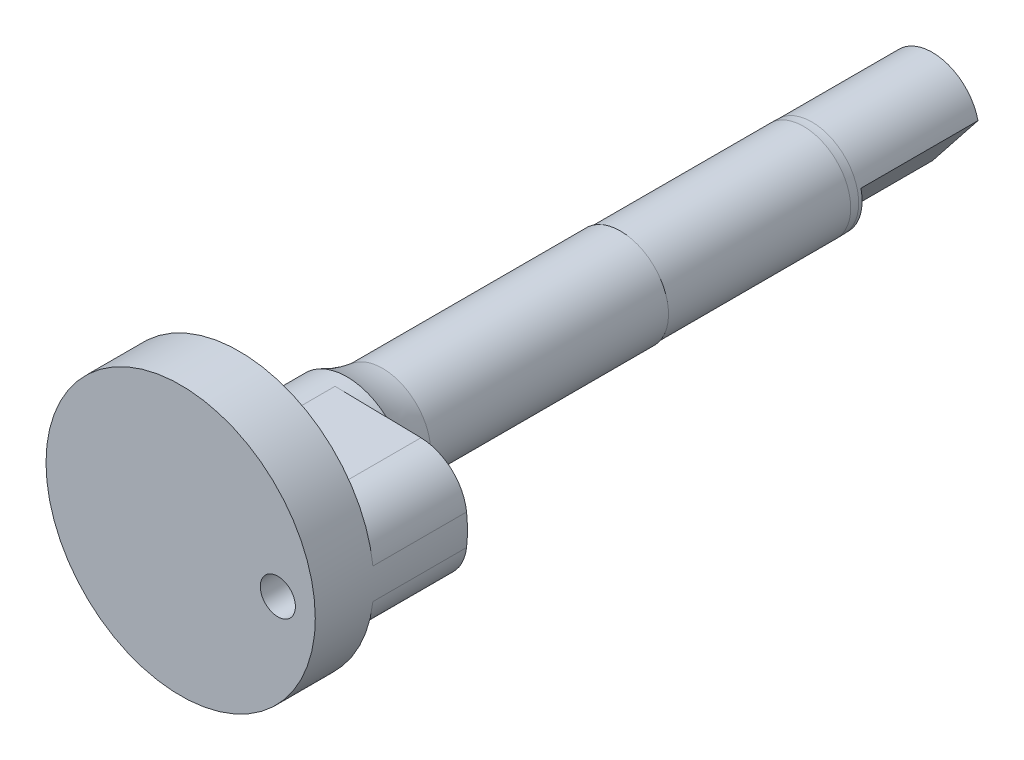
ISO-10303-21;
HEADER;
FILE_DESCRIPTION(('STEP AP214'),'2;1');
FILE_NAME('part.step','',(''),(''),'','','');
FILE_SCHEMA(('AUTOMOTIVE_DESIGN { 1 0 10303 214 1 1 1 1 }'));
ENDSEC;
DATA;
#1=APPLICATION_CONTEXT('core data for automotive mechanical design processes');
#2=APPLICATION_PROTOCOL_DEFINITION('international standard','automotive_design',2000,#1);
#3=PRODUCT_CONTEXT('',#1,'mechanical');
#4=PRODUCT('Part','Part','',(#3));
#5=PRODUCT_RELATED_PRODUCT_CATEGORY('part','',(#4));
#6=PRODUCT_DEFINITION_FORMATION('','',#4);
#7=PRODUCT_DEFINITION_CONTEXT('part definition',#1,'design');
#8=PRODUCT_DEFINITION('design','',#6,#7);
#9=PRODUCT_DEFINITION_SHAPE('','',#8);
#10=(LENGTH_UNIT() NAMED_UNIT(*) SI_UNIT(.MILLI.,.METRE.));
#11=(NAMED_UNIT(*) PLANE_ANGLE_UNIT() SI_UNIT($,.RADIAN.));
#12=(NAMED_UNIT(*) SI_UNIT($,.STERADIAN.) SOLID_ANGLE_UNIT());
#13=UNCERTAINTY_MEASURE_WITH_UNIT(LENGTH_MEASURE(1.E-05),#10,'distance_accuracy_value','');
#14=(GEOMETRIC_REPRESENTATION_CONTEXT(3) GLOBAL_UNCERTAINTY_ASSIGNED_CONTEXT((#13)) GLOBAL_UNIT_ASSIGNED_CONTEXT((#10,
#11,#12)) REPRESENTATION_CONTEXT('',''));
#15=CARTESIAN_POINT('',(0.,0.,0.));
#16=DIRECTION('',(0.,0.,1.));
#17=DIRECTION('',(1.,0.,0.));
#18=AXIS2_PLACEMENT_3D('',#15,#16,#17);
#19=CARTESIAN_POINT('',(0.,0.,100.));
#20=DIRECTION('',(0.,0.,-1.));
#21=DIRECTION('',(-1.,0.,0.));
#22=AXIS2_PLACEMENT_3D('',#19,#20,#21);
#23=CYLINDRICAL_SURFACE('',#22,5.);
#24=DIRECTION('',(0.,0.,1.));
#25=VECTOR('',#24,1.);
#26=CARTESIAN_POINT('',(0.0957609691759967,-4.99908289957093,92.));
#27=LINE('',#26,#25);
#28=CARTESIAN_POINT('',(0.0957609691759966,-4.99908289957093,92.));
#29=VERTEX_POINT('',#28);
#30=CARTESIAN_POINT('',(0.0957609691759967,-4.99908289957093,100.));
#31=VERTEX_POINT('',#30);
#32=EDGE_CURVE('E157',#29,#31,#27,.T.);
#33=ORIENTED_EDGE('',*,*,#32,.T.);
#34=CARTESIAN_POINT('',(0.,0.,100.));
#35=DIRECTION('',(0.,0.,1.));
#36=DIRECTION('',(1.,0.,0.));
#37=AXIS2_PLACEMENT_3D('',#34,#35,#36);
#38=CIRCLE('',#37,5.);
#39=CARTESIAN_POINT('',(0.190610003174259,4.99636546168211,100.));
#40=VERTEX_POINT('',#39);
#41=EDGE_CURVE('E168',#40,#31,#38,.T.);
#42=ORIENTED_EDGE('',*,*,#41,.F.);
#43=DIRECTION('',(0.,0.,-1.));
#44=VECTOR('',#43,1.);
#45=CARTESIAN_POINT('',(0.190610003174295,4.99636546168211,100.));
#46=LINE('',#45,#44);
#47=CARTESIAN_POINT('',(0.190610003174295,4.99636546168211,92.));
#48=VERTEX_POINT('',#47);
#49=EDGE_CURVE('E161',#48,#40,#46,.F.);
#50=ORIENTED_EDGE('',*,*,#49,.F.);
#51=CARTESIAN_POINT('',(0.,0.,92.));
#52=DIRECTION('',(0.,0.,-1.));
#53=DIRECTION('',(-1.,0.,0.));
#54=AXIS2_PLACEMENT_3D('',#51,#52,#53);
#55=CIRCLE('',#54,5.);
#56=EDGE_CURVE('E175',#48,#29,#55,.T.);
#57=ORIENTED_EDGE('',*,*,#56,.T.);
#58=EDGE_LOOP('',(#33,#42,#50,#57));
#59=FACE_BOUND('',#58,.T.);
#60=CARTESIAN_POINT('',(1.59132902168511E-13,3.54432033501201E-13,90.7915232092422));
#61=DIRECTION('',(0.,0.,-1.));
#62=DIRECTION('',(0.,1.,0.));
#63=AXIS2_PLACEMENT_3D('',#60,#61,#62);
#64=CIRCLE('',#63,5.00000000000009);
#65=CARTESIAN_POINT('',(1.59132902168511E-13,5.00000000000044,90.7915232092421));
#66=VERTEX_POINT('',#65);
#67=EDGE_CURVE('E117',#66,#66,#64,.T.);
#68=ORIENTED_EDGE('',*,*,#67,.F.);
#69=EDGE_LOOP('',(#68));
#70=FACE_BOUND('',#69,.T.);
#71=ADVANCED_FACE('F34',(#59,#70),#23,.T.);
#72=CARTESIAN_POINT('',(0.,0.,105.));
#73=DIRECTION('',(0.,0.,-1.));
#74=DIRECTION('',(-1.,0.,0.));
#75=AXIS2_PLACEMENT_3D('',#72,#73,#74);
#76=CYLINDRICAL_SURFACE('',#75,11.5);
#77=CARTESIAN_POINT('',(0.,0.,105.));
#78=DIRECTION('',(0.,0.,1.));
#79=DIRECTION('',(1.,0.,0.));
#80=AXIS2_PLACEMENT_3D('',#77,#78,#79);
#81=CIRCLE('',#80,11.5);
#82=CARTESIAN_POINT('',(11.5,0.,105.));
#83=VERTEX_POINT('',#82);
#84=EDGE_CURVE('E165',#83,#83,#81,.T.);
#85=ORIENTED_EDGE('',*,*,#84,.F.);
#86=EDGE_LOOP('',(#85));
#87=FACE_BOUND('',#86,.T.);
#88=DIRECTION('',(0.,0.,-1.));
#89=VECTOR('',#88,1.);
#90=CARTESIAN_POINT('',(11.4246409362969,1.31437417681885,100.));
#91=LINE('',#90,#89);
#92=CARTESIAN_POINT('',(11.4246409362969,1.31437417681885,100.));
#93=VERTEX_POINT('',#92);
#94=CARTESIAN_POINT('',(11.4246409362969,1.31437417681885,92.));
#95=VERTEX_POINT('',#94);
#96=EDGE_CURVE('E136',#93,#95,#91,.T.);
#97=ORIENTED_EDGE('',*,*,#96,.F.);
#98=CARTESIAN_POINT('',(0.,0.,100.));
#99=DIRECTION('',(0.,0.,1.));
#100=DIRECTION('',(1.,0.,0.));
#101=AXIS2_PLACEMENT_3D('',#98,#99,#100);
#102=CIRCLE('',#101,11.5);
#103=CARTESIAN_POINT('',(11.4245955728607,-1.31476841936944,100.));
#104=VERTEX_POINT('',#103);
#105=EDGE_CURVE('E164',#93,#104,#102,.T.);
#106=ORIENTED_EDGE('',*,*,#105,.T.);
#107=DIRECTION('',(0.,0.,-1.));
#108=VECTOR('',#107,1.);
#109=CARTESIAN_POINT('',(11.4245955728607,-1.31476841936944,100.));
#110=LINE('',#109,#108);
#111=CARTESIAN_POINT('',(11.4245955728607,-1.31476841936944,92.));
#112=VERTEX_POINT('',#111);
#113=EDGE_CURVE('E129',#104,#112,#110,.T.);
#114=ORIENTED_EDGE('',*,*,#113,.T.);
#115=CARTESIAN_POINT('',(0.,0.,92.));
#116=DIRECTION('',(0.,0.,-1.));
#117=DIRECTION('',(-1.,0.,0.));
#118=AXIS2_PLACEMENT_3D('',#115,#116,#117);
#119=CIRCLE('',#118,11.5);
#120=EDGE_CURVE('E152',#95,#112,#119,.T.);
#121=ORIENTED_EDGE('',*,*,#120,.F.);
#122=EDGE_LOOP('',(#97,#106,#114,#121));
#123=FACE_BOUND('',#122,.T.);
#124=ADVANCED_FACE('F205',(#87,#123),#76,.T.);
#125=CARTESIAN_POINT('',(0.,0.,92.));
#126=DIRECTION('',(0.,0.,-1.));
#127=DIRECTION('',(-1.,0.,0.));
#128=AXIS2_PLACEMENT_3D('',#125,#126,#127);
#129=PLANE('',#128);
#130=CARTESIAN_POINT('',(8.30294701481142,0.,92.));
#131=DIRECTION('',(0.,0.,-1.));
#132=DIRECTION('',(-1.,0.,0.));
#133=AXIS2_PLACEMENT_3D('',#130,#131,#132);
#134=CIRCLE('',#133,1.5);
#135=CARTESIAN_POINT('',(6.80294701481142,0.,92.));
#136=VERTEX_POINT('',#135);
#137=EDGE_CURVE('E126',#136,#136,#134,.T.);
#138=ORIENTED_EDGE('',*,*,#137,.F.);
#139=EDGE_LOOP('',(#138));
#140=FACE_BOUND('',#139,.T.);
#141=DIRECTION('',(0.999818256568768,-0.0190644651587437,0.));
#142=VECTOR('',#141,1.);
#143=CARTESIAN_POINT('',(10.4500190304664,4.80073976204611,92.));
#144=LINE('',#143,#142);
#145=CARTESIAN_POINT('',(7.52711064517646,4.85647357637432,92.));
#146=VERTEX_POINT('',#145);
#147=EDGE_CURVE('E149',#48,#146,#144,.T.);
#148=ORIENTED_EDGE('',*,*,#147,.T.);
#149=CARTESIAN_POINT('',(7.45085278454148,0.85720055009925,92.));
#150=DIRECTION('',(0.,0.,-1.));
#151=DIRECTION('',(-1.,0.,0.));
#152=AXIS2_PLACEMENT_3D('',#149,#150,#151);
#153=CIRCLE('',#152,4.);
#154=EDGE_CURVE('E132',#146,#95,#153,.T.);
#155=ORIENTED_EDGE('',*,*,#154,.T.);
#156=ORIENTED_EDGE('',*,*,#120,.T.);
#157=CARTESIAN_POINT('',(7.45082319969177,-0.85745766480616,92.));
#158=DIRECTION('',(0.,0.,-1.));
#159=DIRECTION('',(-1.,0.,0.));
#160=AXIS2_PLACEMENT_3D('',#157,#158,#159);
#161=CIRCLE('',#160,4.);
#162=CARTESIAN_POINT('',(7.52743197503257,-4.8567239844629,92.));
#163=VERTEX_POINT('',#162);
#164=EDGE_CURVE('E135',#112,#163,#161,.T.);
#165=ORIENTED_EDGE('',*,*,#164,.T.);
#166=DIRECTION('',(-0.999816579914185,-0.0191521938351995,0.));
#167=VECTOR('',#166,1.);
#168=CARTESIAN_POINT('',(10.4500190304664,-4.80073976204611,92.));
#169=LINE('',#168,#167);
#170=EDGE_CURVE('E155',#163,#29,#169,.T.);
#171=ORIENTED_EDGE('',*,*,#170,.T.);
#172=ORIENTED_EDGE('',*,*,#56,.F.);
#173=EDGE_LOOP('',(#148,#155,#156,#165,#171,#172));
#174=FACE_BOUND('',#173,.T.);
#175=ADVANCED_FACE('F211',(#140,#174),#129,.T.);
#176=CARTESIAN_POINT('',(10.4500190304664,-4.80073976204611,92.));
#177=DIRECTION('',(-0.0191521938351995,0.999816579914186,0.));
#178=DIRECTION('',(-0.999816579914186,-0.0191521938351995,0.));
#179=AXIS2_PLACEMENT_3D('',#176,#177,#178);
#180=PLANE('',#179);
#181=DIRECTION('',(0.,0.,-1.));
#182=VECTOR('',#181,1.);
#183=CARTESIAN_POINT('',(7.52743197503257,-4.8567239844629,100.));
#184=LINE('',#183,#182);
#185=CARTESIAN_POINT('',(7.52743197503257,-4.8567239844629,100.));
#186=VERTEX_POINT('',#185);
#187=EDGE_CURVE('E141',#186,#163,#184,.T.);
#188=ORIENTED_EDGE('',*,*,#187,.F.);
#189=DIRECTION('',(-0.999816579914185,-0.0191521938351995,0.));
#190=VECTOR('',#189,1.);
#191=CARTESIAN_POINT('',(10.4500190304664,-4.80073976204611,100.));
#192=LINE('',#191,#190);
#193=EDGE_CURVE('E138',#186,#31,#192,.T.);
#194=ORIENTED_EDGE('',*,*,#193,.T.);
#195=ORIENTED_EDGE('',*,*,#32,.F.);
#196=ORIENTED_EDGE('',*,*,#170,.F.);
#197=EDGE_LOOP('',(#188,#194,#195,#196));
#198=FACE_BOUND('',#197,.T.);
#199=ADVANCED_FACE('F245',(#198),#180,.F.);
#200=CARTESIAN_POINT('',(0.,0.,100.));
#201=DIRECTION('',(0.,0.,1.));
#202=DIRECTION('',(1.,0.,0.));
#203=AXIS2_PLACEMENT_3D('',#200,#201,#202);
#204=PLANE('',#203);
#205=DIRECTION('',(0.999818256568768,-0.0190644651587437,0.));
#206=VECTOR('',#205,1.);
#207=CARTESIAN_POINT('',(0.0953050015871559,4.99818273084106,100.));
#208=LINE('',#207,#206);
#209=CARTESIAN_POINT('',(7.52711064517646,4.85647357637432,100.));
#210=VERTEX_POINT('',#209);
#211=EDGE_CURVE('E172',#40,#210,#208,.T.);
#212=ORIENTED_EDGE('',*,*,#211,.F.);
#213=ORIENTED_EDGE('',*,*,#41,.T.);
#214=ORIENTED_EDGE('',*,*,#193,.F.);
#215=CARTESIAN_POINT('',(7.45082319969177,-0.85745766480616,100.));
#216=DIRECTION('',(0.,0.,-1.));
#217=DIRECTION('',(-1.,0.,0.));
#218=AXIS2_PLACEMENT_3D('',#215,#216,#217);
#219=CIRCLE('',#218,4.);
#220=EDGE_CURVE('E143',#104,#186,#219,.T.);
#221=ORIENTED_EDGE('',*,*,#220,.F.);
#222=ORIENTED_EDGE('',*,*,#105,.F.);
#223=CARTESIAN_POINT('',(7.45085278454148,0.85720055009925,100.));
#224=DIRECTION('',(0.,0.,-1.));
#225=DIRECTION('',(-1.,0.,0.));
#226=AXIS2_PLACEMENT_3D('',#223,#224,#225);
#227=CIRCLE('',#226,4.);
#228=EDGE_CURVE('E57',#210,#93,#227,.T.);
#229=ORIENTED_EDGE('',*,*,#228,.F.);
#230=EDGE_LOOP('',(#212,#213,#214,#221,#222,#229));
#231=FACE_BOUND('',#230,.T.);
#232=ADVANCED_FACE('F249',(#231),#204,.F.);
#233=CARTESIAN_POINT('',(0.,0.,105.));
#234=DIRECTION('',(0.,0.,1.));
#235=DIRECTION('',(1.,0.,0.));
#236=AXIS2_PLACEMENT_3D('',#233,#234,#235);
#237=PLANE('',#236);
#238=CARTESIAN_POINT('',(8.30294701481142,0.,105.));
#239=DIRECTION('',(0.,0.,1.));
#240=DIRECTION('',(1.,0.,0.));
#241=AXIS2_PLACEMENT_3D('',#238,#239,#240);
#242=CIRCLE('',#241,1.5);
#243=CARTESIAN_POINT('',(9.80294701481142,0.,105.));
#244=VERTEX_POINT('',#243);
#245=EDGE_CURVE('E123',#244,#244,#242,.T.);
#246=ORIENTED_EDGE('',*,*,#245,.F.);
#247=EDGE_LOOP('',(#246));
#248=FACE_BOUND('',#247,.T.);
#249=ORIENTED_EDGE('',*,*,#84,.T.);
#250=EDGE_LOOP('',(#249));
#251=FACE_BOUND('',#250,.T.);
#252=ADVANCED_FACE('F253',(#248,#251),#237,.T.);
#253=CARTESIAN_POINT('',(10.4500190304664,4.80073976204611,92.));
#254=DIRECTION('',(-0.0190644651587437,-0.999818256568768,0.));
#255=DIRECTION('',(0.999818256568768,-0.0190644651587437,0.));
#256=AXIS2_PLACEMENT_3D('',#253,#254,#255);
#257=PLANE('',#256);
#258=ORIENTED_EDGE('',*,*,#211,.T.);
#259=DIRECTION('',(0.,0.,-1.));
#260=VECTOR('',#259,1.);
#261=CARTESIAN_POINT('',(7.52711064517646,4.85647357637432,100.));
#262=LINE('',#261,#260);
#263=EDGE_CURVE('E131',#210,#146,#262,.T.);
#264=ORIENTED_EDGE('',*,*,#263,.T.);
#265=ORIENTED_EDGE('',*,*,#147,.F.);
#266=ORIENTED_EDGE('',*,*,#49,.T.);
#267=EDGE_LOOP('',(#258,#264,#265,#266));
#268=FACE_BOUND('',#267,.T.);
#269=ADVANCED_FACE('F241',(#268),#257,.F.);
#270=CARTESIAN_POINT('',(7.45082319969177,-0.85745766480616,100.));
#271=DIRECTION('',(0.,0.,-1.));
#272=DIRECTION('',(-1.,0.,0.));
#273=AXIS2_PLACEMENT_3D('',#270,#271,#272);
#274=CYLINDRICAL_SURFACE('',#273,4.);
#275=ORIENTED_EDGE('',*,*,#164,.F.);
#276=ORIENTED_EDGE('',*,*,#113,.F.);
#277=ORIENTED_EDGE('',*,*,#220,.T.);
#278=ORIENTED_EDGE('',*,*,#187,.T.);
#279=EDGE_LOOP('',(#275,#276,#277,#278));
#280=FACE_BOUND('',#279,.T.);
#281=ADVANCED_FACE('F234',(#280),#274,.T.);
#282=CARTESIAN_POINT('',(7.45085278454148,0.85720055009925,100.));
#283=DIRECTION('',(0.,0.,-1.));
#284=DIRECTION('',(-1.,0.,0.));
#285=AXIS2_PLACEMENT_3D('',#282,#283,#284);
#286=CYLINDRICAL_SURFACE('',#285,4.);
#287=ORIENTED_EDGE('',*,*,#154,.F.);
#288=ORIENTED_EDGE('',*,*,#263,.F.);
#289=ORIENTED_EDGE('',*,*,#228,.T.);
#290=ORIENTED_EDGE('',*,*,#96,.T.);
#291=EDGE_LOOP('',(#287,#288,#289,#290));
#292=FACE_BOUND('',#291,.T.);
#293=ADVANCED_FACE('F227',(#292),#286,.T.);
#294=CARTESIAN_POINT('',(8.30294701481142,0.,65.7915232092421));
#295=DIRECTION('',(0.,0.,1.));
#296=DIRECTION('',(1.,0.,0.));
#297=AXIS2_PLACEMENT_3D('',#294,#295,#296);
#298=CYLINDRICAL_SURFACE('',#297,1.5);
#299=ORIENTED_EDGE('',*,*,#137,.T.);
#300=EDGE_LOOP('',(#299));
#301=FACE_BOUND('',#300,.T.);
#302=ORIENTED_EDGE('',*,*,#245,.T.);
#303=EDGE_LOOP('',(#302));
#304=FACE_BOUND('',#303,.T.);
#305=ADVANCED_FACE('F219',(#301,#304),#298,.F.);
#306=CARTESIAN_POINT('',(0.,0.,86.4846246731729));
#307=DIRECTION('',(0.,0.,1.));
#308=DIRECTION('',(0.,-1.,0.));
#309=AXIS2_PLACEMENT_3D('',#306,#307,#308);
#310=TOROIDAL_SURFACE('',#309,14.0250000000002,10.);
#311=CARTESIAN_POINT('',(0.,0.,87.7470033802173));
#312=DIRECTION('',(0.,0.,-1.));
#313=DIRECTION('',(0.,1.,0.));
#314=AXIS2_PLACEMENT_3D('',#311,#312,#313);
#315=CIRCLE('',#314,4.10500000000018);
#316=CARTESIAN_POINT('',(0.,4.10500000000017,87.7470033802173));
#317=VERTEX_POINT('',#316);
#318=EDGE_CURVE('E112',#317,#317,#315,.F.);
#319=ORIENTED_EDGE('',*,*,#318,.T.);
#320=EDGE_LOOP('',(#319));
#321=FACE_BOUND('',#320,.T.);
#322=ORIENTED_EDGE('',*,*,#67,.T.);
#323=EDGE_LOOP('',(#322));
#324=FACE_BOUND('',#323,.T.);
#325=ADVANCED_FACE('F216',(#321,#324),#310,.F.);
#326=CARTESIAN_POINT('',(1.67878652028311E-13,3.77811954131546E-13,92.4320394735835));
#327=DIRECTION('',(0.,0.,-1.));
#328=DIRECTION('',(0.,1.,0.));
#329=AXIS2_PLACEMENT_3D('',#326,#327,#328);
#330=CYLINDRICAL_SURFACE('',#329,4.10500000000018);
#331=ORIENTED_EDGE('',*,*,#318,.F.);
#332=EDGE_LOOP('',(#331));
#333=FACE_BOUND('',#332,.T.);
#334=CARTESIAN_POINT('',(1.18042009972263E-13,2.78301871186421E-13,67.4320394735835));
#335=DIRECTION('',(0.,0.,-1.));
#336=DIRECTION('',(0.,1.,0.));
#337=AXIS2_PLACEMENT_3D('',#334,#335,#336);
#338=CIRCLE('',#337,4.10500000000021);
#339=CARTESIAN_POINT('',(1.18042009972263E-13,4.10500000000049,67.4320394735835));
#340=VERTEX_POINT('',#339);
#341=EDGE_CURVE('E181',#340,#340,#338,.T.);
#342=ORIENTED_EDGE('',*,*,#341,.F.);
#343=EDGE_LOOP('',(#342));
#344=FACE_BOUND('',#343,.T.);
#345=ADVANCED_FACE('F218',(#333,#344),#330,.T.);
#346=CARTESIAN_POINT('',(1.18042009972263E-13,2.78301871186421E-13,67.4320394735835));
#347=DIRECTION('',(0.,0.,-1.));
#348=DIRECTION('',(0.,1.,0.));
#349=AXIS2_PLACEMENT_3D('',#346,#347,#348);
#350=PLANE('',#349);
#351=CARTESIAN_POINT('',(1.18190066222841E-13,2.63241258973862E-13,67.4320394735835));
#352=DIRECTION('',(0.,0.,-1.));
#353=DIRECTION('',(0.,1.,0.));
#354=AXIS2_PLACEMENT_3D('',#351,#352,#353);
#355=CIRCLE('',#354,4.02500000000023);
#356=CARTESIAN_POINT('',(1.18190066222841E-13,4.02500000000049,67.4320394735835));
#357=VERTEX_POINT('',#356);
#358=EDGE_CURVE('E11',#357,#357,#355,.F.);
#359=ORIENTED_EDGE('',*,*,#358,.T.);
#360=EDGE_LOOP('',(#359));
#361=FACE_BOUND('',#360,.T.);
#362=ORIENTED_EDGE('',*,*,#341,.T.);
#363=EDGE_LOOP('',(#362));
#364=FACE_BOUND('',#363,.T.);
#365=ADVANCED_FACE('F224',(#361,#364),#350,.T.);
#366=CARTESIAN_POINT('',(0.,1.59241986582195E-13,40.7915232092422));
#367=DIRECTION('',(0.,0.,-1.));
#368=DIRECTION('',(0.,1.,0.));
#369=AXIS2_PLACEMENT_3D('',#366,#367,#368);
#370=PLANE('',#369);
#371=DIRECTION('',(-0.621118012422321,-0.783717050117289,0.));
#372=VECTOR('',#371,1.);
#373=CARTESIAN_POINT('',(1.9592926252933,-1.55279503105566,40.7915232092422));
#374=LINE('',#373,#372);
#375=CARTESIAN_POINT('',(3.89873299746659,0.894360673590936,40.7915232092422));
#376=VERTEX_POINT('',#375);
#377=CARTESIAN_POINT('',(0.0198522531200328,-3.99995073570223,40.7915232092422));
#378=VERTEX_POINT('',#377);
#379=EDGE_CURVE('E111',#376,#378,#374,.T.);
#380=ORIENTED_EDGE('',*,*,#379,.T.);
#381=CARTESIAN_POINT('',(0.,1.59241986582195E-13,40.7915232092422));
#382=DIRECTION('',(0.,0.,-1.));
#383=DIRECTION('',(0.,1.,0.));
#384=AXIS2_PLACEMENT_3D('',#381,#382,#383);
#385=CIRCLE('',#384,4.);
#386=EDGE_CURVE('E100',#378,#376,#385,.T.);
#387=ORIENTED_EDGE('',*,*,#386,.T.);
#388=EDGE_LOOP('',(#380,#387));
#389=FACE_BOUND('',#388,.T.);
#390=ADVANCED_FACE('F110',(#389),#370,.T.);
#391=CARTESIAN_POINT('',(1.95929262529332,-1.55279503105562,50.7915232092422));
#392=DIRECTION('',(0.783717050117289,-0.621118012422321,0.));
#393=DIRECTION('',(0.621118012422321,0.783717050117289,0.));
#394=AXIS2_PLACEMENT_3D('',#391,#392,#393);
#395=PLANE('',#394);
#396=DIRECTION('',(-0.621118012422321,-0.783717050117289,0.));
#397=VECTOR('',#396,1.);
#398=CARTESIAN_POINT('',(1.95929262529332,-1.55279503105562,50.7915232092422));
#399=LINE('',#398,#397);
#400=CARTESIAN_POINT('',(3.89873299746661,0.894360673590958,50.7915232092422));
#401=VERTEX_POINT('',#400);
#402=CARTESIAN_POINT('',(0.0198522531200415,-3.99995073570219,50.7915232092422));
#403=VERTEX_POINT('',#402);
#404=EDGE_CURVE('E115',#401,#403,#399,.T.);
#405=ORIENTED_EDGE('',*,*,#404,.T.);
#406=DIRECTION('',(0.,0.,-1.));
#407=VECTOR('',#406,1.);
#408=CARTESIAN_POINT('',(0.0198522531200433,-3.99995073570218,51.7915232092422));
#409=LINE('',#408,#407);
#410=EDGE_CURVE('E49',#403,#378,#409,.T.);
#411=ORIENTED_EDGE('',*,*,#410,.T.);
#412=ORIENTED_EDGE('',*,*,#379,.F.);
#413=DIRECTION('',(0.,0.,-1.));
#414=VECTOR('',#413,1.);
#415=CARTESIAN_POINT('',(3.89873299746661,0.894360673590962,51.7915232092422));
#416=LINE('',#415,#414);
#417=EDGE_CURVE('E97',#376,#401,#416,.F.);
#418=ORIENTED_EDGE('',*,*,#417,.T.);
#419=EDGE_LOOP('',(#405,#411,#412,#418));
#420=FACE_BOUND('',#419,.T.);
#421=ADVANCED_FACE('F114',(#420),#395,.T.);
#422=CARTESIAN_POINT('',(0.,1.96349478311079E-13,50.7915232092422));
#423=DIRECTION('',(0.,0.,-1.));
#424=DIRECTION('',(0.,1.,0.));
#425=AXIS2_PLACEMENT_3D('',#422,#423,#424);
#426=PLANE('',#425);
#427=ORIENTED_EDGE('',*,*,#404,.F.);
#428=CARTESIAN_POINT('',(0.,1.98279995965996E-13,50.7915232092422));
#429=DIRECTION('',(0.,0.,-1.));
#430=DIRECTION('',(0.,1.,0.));
#431=AXIS2_PLACEMENT_3D('',#428,#429,#430);
#432=CIRCLE('',#431,4.);
#433=EDGE_CURVE('E101',#401,#403,#432,.T.);
#434=ORIENTED_EDGE('',*,*,#433,.T.);
#435=EDGE_LOOP('',(#427,#434));
#436=FACE_BOUND('',#435,.T.);
#437=ADVANCED_FACE('F314',(#436),#426,.T.);
#438=CARTESIAN_POINT('',(0.,2.02183796904376E-13,51.7915232092422));
#439=DIRECTION('',(0.,0.,-1.));
#440=DIRECTION('',(0.,1.,0.));
#441=AXIS2_PLACEMENT_3D('',#438,#439,#440);
#442=CYLINDRICAL_SURFACE('',#441,4.);
#443=CARTESIAN_POINT('',(0.,1.99425118580484E-13,51.0848585079838));
#444=DIRECTION('',(0.,0.,1.));
#445=DIRECTION('',(0.,-1.,0.));
#446=AXIS2_PLACEMENT_3D('',#443,#444,#445);
#447=CIRCLE('',#446,4.);
#448=CARTESIAN_POINT('',(0.,-3.9999999999998,51.0848585079839));
#449=VERTEX_POINT('',#448);
#450=EDGE_CURVE('E42',#449,#449,#447,.F.);
#451=ORIENTED_EDGE('',*,*,#450,.T.);
#452=EDGE_LOOP('',(#451));
#453=FACE_BOUND('',#452,.T.);
#454=ORIENTED_EDGE('',*,*,#433,.F.);
#455=ORIENTED_EDGE('',*,*,#417,.F.);
#456=ORIENTED_EDGE('',*,*,#386,.F.);
#457=ORIENTED_EDGE('',*,*,#410,.F.);
#458=EDGE_LOOP('',(#454,#455,#456,#457));
#459=FACE_BOUND('',#458,.T.);
#460=ADVANCED_FACE('F99',(#453,#459),#442,.T.);
#461=CARTESIAN_POINT('',(0.,1.99425118580484E-13,51.0848585079838));
#462=DIRECTION('',(0.,0.,1.));
#463=DIRECTION('',(0.,-1.,0.));
#464=AXIS2_PLACEMENT_3D('',#461,#462,#463);
#465=TOROIDAL_SURFACE('',#464,14.,10.);
#466=CARTESIAN_POINT('',(0.,2.02183796904376E-13,51.7915232092422));
#467=DIRECTION('',(0.,0.,-1.));
#468=DIRECTION('',(0.,1.,0.));
#469=AXIS2_PLACEMENT_3D('',#466,#467,#468);
#470=CIRCLE('',#469,4.025);
#471=CARTESIAN_POINT('',(0.,4.0250000000002,51.7915232092422));
#472=VERTEX_POINT('',#471);
#473=EDGE_CURVE('E106',#472,#472,#470,.T.);
#474=ORIENTED_EDGE('',*,*,#473,.T.);
#475=EDGE_LOOP('',(#474));
#476=FACE_BOUND('',#475,.T.);
#477=ORIENTED_EDGE('',*,*,#450,.F.);
#478=EDGE_LOOP('',(#477));
#479=FACE_BOUND('',#478,.T.);
#480=ADVANCED_FACE('F36',(#476,#479),#465,.F.);
#481=CARTESIAN_POINT('',(1.59132902168511E-13,3.54432033501201E-13,90.7915232092422));
#482=DIRECTION('',(0.,0.,-1.));
#483=DIRECTION('',(0.,1.,0.));
#484=AXIS2_PLACEMENT_3D('',#481,#482,#483);
#485=CYLINDRICAL_SURFACE('',#484,4.02500000000023);
#486=ORIENTED_EDGE('',*,*,#358,.F.);
#487=EDGE_LOOP('',(#486));
#488=FACE_BOUND('',#487,.T.);
#489=ORIENTED_EDGE('',*,*,#473,.F.);
#490=EDGE_LOOP('',(#489));
#491=FACE_BOUND('',#490,.T.);
#492=ADVANCED_FACE('F194',(#488,#491),#485,.T.);
#493=CLOSED_SHELL('',(#71,#124,#175,#199,#232,#252,#269,#281,#293,#305,#325,#345,#365,#390,#421,
#437,#460,#480,#492));
#494=MANIFOLD_SOLID_BREP('B2',#493);
#495=ADVANCED_BREP_SHAPE_REPRESENTATION('',(#18,#494),#14);
#496=SHAPE_DEFINITION_REPRESENTATION(#9,#495);
ENDSEC;
END-ISO-10303-21;
